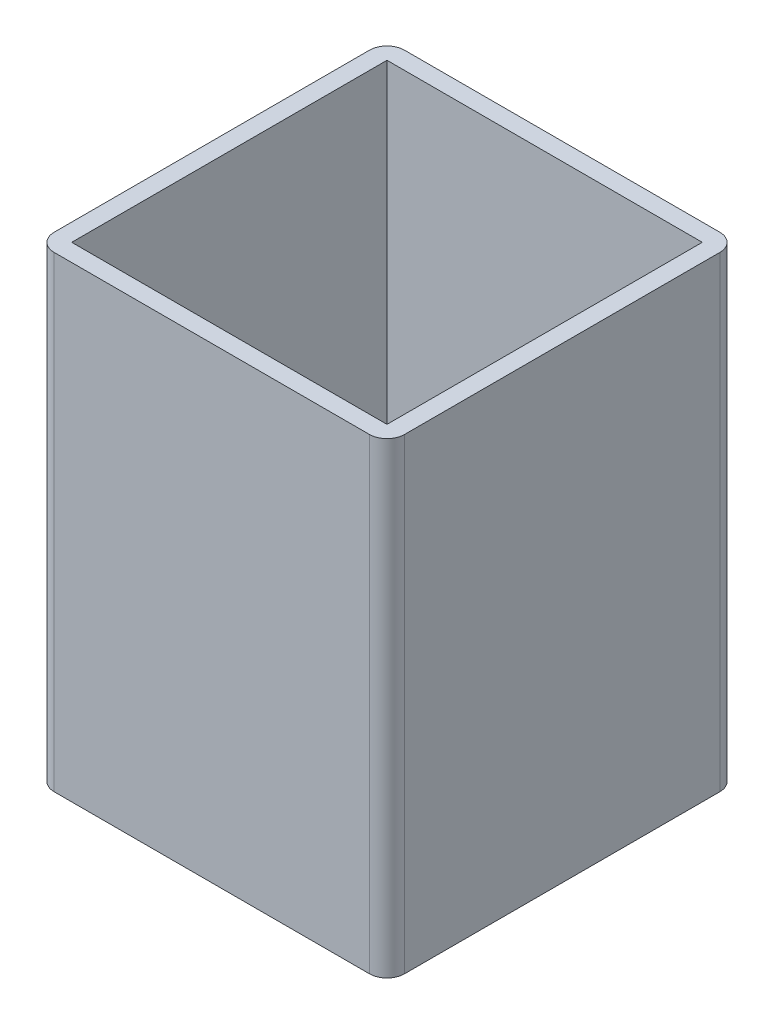
ISO-10303-21;
HEADER;
FILE_DESCRIPTION(('STEP AP214'),'2;1');
FILE_NAME('part.step','',(''),(''),'','','');
FILE_SCHEMA(('AUTOMOTIVE_DESIGN { 1 0 10303 214 1 1 1 1 }'));
ENDSEC;
DATA;
#1=APPLICATION_CONTEXT('core data for automotive mechanical design processes');
#2=APPLICATION_PROTOCOL_DEFINITION('international standard','automotive_design',2000,#1);
#3=PRODUCT_CONTEXT('',#1,'mechanical');
#4=PRODUCT('Part','Part','',(#3));
#5=PRODUCT_RELATED_PRODUCT_CATEGORY('part','',(#4));
#6=PRODUCT_DEFINITION_FORMATION('','',#4);
#7=PRODUCT_DEFINITION_CONTEXT('part definition',#1,'design');
#8=PRODUCT_DEFINITION('design','',#6,#7);
#9=PRODUCT_DEFINITION_SHAPE('','',#8);
#10=(LENGTH_UNIT() NAMED_UNIT(*) SI_UNIT(.MILLI.,.METRE.));
#11=(NAMED_UNIT(*) PLANE_ANGLE_UNIT() SI_UNIT($,.RADIAN.));
#12=(NAMED_UNIT(*) SI_UNIT($,.STERADIAN.) SOLID_ANGLE_UNIT());
#13=UNCERTAINTY_MEASURE_WITH_UNIT(LENGTH_MEASURE(1.E-05),#10,'distance_accuracy_value','');
#14=(GEOMETRIC_REPRESENTATION_CONTEXT(3) GLOBAL_UNCERTAINTY_ASSIGNED_CONTEXT((#13)) GLOBAL_UNIT_ASSIGNED_CONTEXT((#10,
#11,#12)) REPRESENTATION_CONTEXT('',''));
#15=CARTESIAN_POINT('',(0.,0.,0.));
#16=DIRECTION('',(0.,0.,1.));
#17=DIRECTION('',(1.,0.,0.));
#18=AXIS2_PLACEMENT_3D('',#15,#16,#17);
#19=CARTESIAN_POINT('',(0.,80.,0.));
#20=DIRECTION('',(0.,-1.,0.));
#21=DIRECTION('',(0.,0.,-1.));
#22=AXIS2_PLACEMENT_3D('',#19,#20,#21);
#23=PLANE('',#22);
#24=DIRECTION('',(-1.,0.,0.));
#25=VECTOR('',#24,1.);
#26=CARTESIAN_POINT('',(0.,80.,-60.));
#27=LINE('',#26,#25);
#28=CARTESIAN_POINT('',(57.,80.,-60.));
#29=VERTEX_POINT('',#28);
#30=CARTESIAN_POINT('',(3.,80.,-60.));
#31=VERTEX_POINT('',#30);
#32=EDGE_CURVE('E174',#29,#31,#27,.T.);
#33=ORIENTED_EDGE('',*,*,#32,.T.);
#34=CARTESIAN_POINT('',(3.,80.,-57.));
#35=DIRECTION('',(0.,-1.,0.));
#36=DIRECTION('',(0.,0.,-1.));
#37=AXIS2_PLACEMENT_3D('',#34,#35,#36);
#38=CIRCLE('',#37,3.);
#39=CARTESIAN_POINT('',(0.,80.,-57.));
#40=VERTEX_POINT('',#39);
#41=EDGE_CURVE('E209',#31,#40,#38,.F.);
#42=ORIENTED_EDGE('',*,*,#41,.T.);
#43=DIRECTION('',(0.,0.,1.));
#44=VECTOR('',#43,1.);
#45=CARTESIAN_POINT('',(0.,80.,0.));
#46=LINE('',#45,#44);
#47=CARTESIAN_POINT('',(0.,80.,-3.));
#48=VERTEX_POINT('',#47);
#49=EDGE_CURVE('E166',#40,#48,#46,.T.);
#50=ORIENTED_EDGE('',*,*,#49,.T.);
#51=CARTESIAN_POINT('',(3.,80.,-3.));
#52=DIRECTION('',(0.,-1.,0.));
#53=DIRECTION('',(0.,0.,-1.));
#54=AXIS2_PLACEMENT_3D('',#51,#52,#53);
#55=CIRCLE('',#54,3.);
#56=CARTESIAN_POINT('',(3.,80.,0.));
#57=VERTEX_POINT('',#56);
#58=EDGE_CURVE('E207',#48,#57,#55,.F.);
#59=ORIENTED_EDGE('',*,*,#58,.T.);
#60=DIRECTION('',(1.,0.,0.));
#61=VECTOR('',#60,1.);
#62=CARTESIAN_POINT('',(0.,80.,0.));
#63=LINE('',#62,#61);
#64=CARTESIAN_POINT('',(57.,80.,0.));
#65=VERTEX_POINT('',#64);
#66=EDGE_CURVE('E169',#57,#65,#63,.T.);
#67=ORIENTED_EDGE('',*,*,#66,.T.);
#68=CARTESIAN_POINT('',(57.,80.,-3.));
#69=DIRECTION('',(0.,-1.,0.));
#70=DIRECTION('',(0.,0.,-1.));
#71=AXIS2_PLACEMENT_3D('',#68,#69,#70);
#72=CIRCLE('',#71,3.);
#73=CARTESIAN_POINT('',(60.,80.,-3.));
#74=VERTEX_POINT('',#73);
#75=EDGE_CURVE('E55',#65,#74,#72,.F.);
#76=ORIENTED_EDGE('',*,*,#75,.T.);
#77=DIRECTION('',(0.,0.,-1.));
#78=VECTOR('',#77,1.);
#79=CARTESIAN_POINT('',(60.,80.,0.));
#80=LINE('',#79,#78);
#81=CARTESIAN_POINT('',(60.,80.,-57.));
#82=VERTEX_POINT('',#81);
#83=EDGE_CURVE('E172',#74,#82,#80,.T.);
#84=ORIENTED_EDGE('',*,*,#83,.T.);
#85=CARTESIAN_POINT('',(57.,80.,-57.));
#86=DIRECTION('',(0.,-1.,0.));
#87=DIRECTION('',(0.,0.,-1.));
#88=AXIS2_PLACEMENT_3D('',#85,#86,#87);
#89=CIRCLE('',#88,3.);
#90=EDGE_CURVE('E204',#82,#29,#89,.F.);
#91=ORIENTED_EDGE('',*,*,#90,.T.);
#92=EDGE_LOOP('',(#33,#42,#50,#59,#67,#76,#84,#91));
#93=FACE_BOUND('',#92,.T.);
#94=DIRECTION('',(0.,0.,1.));
#95=VECTOR('',#94,1.);
#96=CARTESIAN_POINT('',(3.,80.,-3.));
#97=LINE('',#96,#95);
#98=CARTESIAN_POINT('',(3.,80.,-57.));
#99=VERTEX_POINT('',#98);
#100=CARTESIAN_POINT('',(3.,80.,-3.));
#101=VERTEX_POINT('',#100);
#102=EDGE_CURVE('E125',#99,#101,#97,.T.);
#103=ORIENTED_EDGE('',*,*,#102,.F.);
#104=DIRECTION('',(-1.,0.,0.));
#105=VECTOR('',#104,1.);
#106=CARTESIAN_POINT('',(3.,80.,-57.));
#107=LINE('',#106,#105);
#108=CARTESIAN_POINT('',(57.,80.,-57.));
#109=VERTEX_POINT('',#108);
#110=EDGE_CURVE('E150',#109,#99,#107,.T.);
#111=ORIENTED_EDGE('',*,*,#110,.F.);
#112=DIRECTION('',(0.,0.,-1.));
#113=VECTOR('',#112,1.);
#114=CARTESIAN_POINT('',(57.,80.,-3.));
#115=LINE('',#114,#113);
#116=CARTESIAN_POINT('',(57.,80.,-3.));
#117=VERTEX_POINT('',#116);
#118=EDGE_CURVE('E148',#117,#109,#115,.T.);
#119=ORIENTED_EDGE('',*,*,#118,.F.);
#120=DIRECTION('',(1.,0.,0.));
#121=VECTOR('',#120,1.);
#122=CARTESIAN_POINT('',(3.,80.,-3.));
#123=LINE('',#122,#121);
#124=EDGE_CURVE('E135',#101,#117,#123,.T.);
#125=ORIENTED_EDGE('',*,*,#124,.F.);
#126=EDGE_LOOP('',(#103,#111,#119,#125));
#127=FACE_BOUND('',#126,.T.);
#128=ADVANCED_FACE('F34',(#93,#127),#23,.F.);
#129=CARTESIAN_POINT('',(0.,0.,0.));
#130=DIRECTION('',(0.,-1.,0.));
#131=DIRECTION('',(0.,0.,-1.));
#132=AXIS2_PLACEMENT_3D('',#129,#130,#131);
#133=PLANE('',#132);
#134=DIRECTION('',(0.,0.,1.));
#135=VECTOR('',#134,1.);
#136=CARTESIAN_POINT('',(0.,0.,0.));
#137=LINE('',#136,#135);
#138=CARTESIAN_POINT('',(0.,0.,-57.));
#139=VERTEX_POINT('',#138);
#140=CARTESIAN_POINT('',(0.,0.,-3.));
#141=VERTEX_POINT('',#140);
#142=EDGE_CURVE('E143',#139,#141,#137,.T.);
#143=ORIENTED_EDGE('',*,*,#142,.F.);
#144=CARTESIAN_POINT('',(3.,0.,-57.));
#145=DIRECTION('',(0.,-1.,0.));
#146=DIRECTION('',(0.,0.,-1.));
#147=AXIS2_PLACEMENT_3D('',#144,#145,#146);
#148=CIRCLE('',#147,3.);
#149=CARTESIAN_POINT('',(3.,0.,-60.));
#150=VERTEX_POINT('',#149);
#151=EDGE_CURVE('E197',#139,#150,#148,.T.);
#152=ORIENTED_EDGE('',*,*,#151,.T.);
#153=DIRECTION('',(-1.,0.,0.));
#154=VECTOR('',#153,1.);
#155=CARTESIAN_POINT('',(0.,0.,-60.));
#156=LINE('',#155,#154);
#157=CARTESIAN_POINT('',(57.,0.,-60.));
#158=VERTEX_POINT('',#157);
#159=EDGE_CURVE('E170',#158,#150,#156,.T.);
#160=ORIENTED_EDGE('',*,*,#159,.F.);
#161=CARTESIAN_POINT('',(57.,0.,-57.));
#162=DIRECTION('',(0.,-1.,0.));
#163=DIRECTION('',(0.,0.,-1.));
#164=AXIS2_PLACEMENT_3D('',#161,#162,#163);
#165=CIRCLE('',#164,3.);
#166=CARTESIAN_POINT('',(60.,0.,-57.));
#167=VERTEX_POINT('',#166);
#168=EDGE_CURVE('E191',#158,#167,#165,.T.);
#169=ORIENTED_EDGE('',*,*,#168,.T.);
#170=DIRECTION('',(0.,0.,-1.));
#171=VECTOR('',#170,1.);
#172=CARTESIAN_POINT('',(60.,0.,0.));
#173=LINE('',#172,#171);
#174=CARTESIAN_POINT('',(60.,0.,-3.));
#175=VERTEX_POINT('',#174);
#176=EDGE_CURVE('E183',#175,#167,#173,.T.);
#177=ORIENTED_EDGE('',*,*,#176,.F.);
#178=CARTESIAN_POINT('',(57.,0.,-3.));
#179=DIRECTION('',(0.,-1.,0.));
#180=DIRECTION('',(0.,0.,-1.));
#181=AXIS2_PLACEMENT_3D('',#178,#179,#180);
#182=CIRCLE('',#181,3.);
#183=CARTESIAN_POINT('',(57.,0.,0.));
#184=VERTEX_POINT('',#183);
#185=EDGE_CURVE('E193',#175,#184,#182,.T.);
#186=ORIENTED_EDGE('',*,*,#185,.T.);
#187=DIRECTION('',(1.,0.,0.));
#188=VECTOR('',#187,1.);
#189=CARTESIAN_POINT('',(0.,0.,0.));
#190=LINE('',#189,#188);
#191=CARTESIAN_POINT('',(3.,0.,0.));
#192=VERTEX_POINT('',#191);
#193=EDGE_CURVE('E180',#192,#184,#190,.T.);
#194=ORIENTED_EDGE('',*,*,#193,.F.);
#195=CARTESIAN_POINT('',(3.,0.,-3.));
#196=DIRECTION('',(0.,-1.,0.));
#197=DIRECTION('',(0.,0.,-1.));
#198=AXIS2_PLACEMENT_3D('',#195,#196,#197);
#199=CIRCLE('',#198,3.);
#200=EDGE_CURVE('E195',#192,#141,#199,.T.);
#201=ORIENTED_EDGE('',*,*,#200,.T.);
#202=EDGE_LOOP('',(#143,#152,#160,#169,#177,#186,#194,#201));
#203=FACE_BOUND('',#202,.T.);
#204=DIRECTION('',(-1.,0.,0.));
#205=VECTOR('',#204,1.);
#206=CARTESIAN_POINT('',(3.,0.,-57.));
#207=LINE('',#206,#205);
#208=CARTESIAN_POINT('',(57.,0.,-57.));
#209=VERTEX_POINT('',#208);
#210=CARTESIAN_POINT('',(3.,0.,-57.));
#211=VERTEX_POINT('',#210);
#212=EDGE_CURVE('E136',#209,#211,#207,.T.);
#213=ORIENTED_EDGE('',*,*,#212,.T.);
#214=DIRECTION('',(0.,0.,1.));
#215=VECTOR('',#214,1.);
#216=CARTESIAN_POINT('',(3.,0.,-3.));
#217=LINE('',#216,#215);
#218=CARTESIAN_POINT('',(3.,0.,-3.));
#219=VERTEX_POINT('',#218);
#220=EDGE_CURVE('E154',#211,#219,#217,.T.);
#221=ORIENTED_EDGE('',*,*,#220,.T.);
#222=DIRECTION('',(1.,0.,0.));
#223=VECTOR('',#222,1.);
#224=CARTESIAN_POINT('',(3.,0.,-3.));
#225=LINE('',#224,#223);
#226=CARTESIAN_POINT('',(57.,0.,-3.));
#227=VERTEX_POINT('',#226);
#228=EDGE_CURVE('E142',#219,#227,#225,.T.);
#229=ORIENTED_EDGE('',*,*,#228,.T.);
#230=DIRECTION('',(0.,0.,-1.));
#231=VECTOR('',#230,1.);
#232=CARTESIAN_POINT('',(57.,0.,-3.));
#233=LINE('',#232,#231);
#234=EDGE_CURVE('E157',#227,#209,#233,.T.);
#235=ORIENTED_EDGE('',*,*,#234,.T.);
#236=EDGE_LOOP('',(#213,#221,#229,#235));
#237=FACE_BOUND('',#236,.T.);
#238=ADVANCED_FACE('F225',(#203,#237),#133,.T.);
#239=CARTESIAN_POINT('',(0.,80.,0.));
#240=DIRECTION('',(1.,0.,0.));
#241=DIRECTION('',(0.,0.,-1.));
#242=AXIS2_PLACEMENT_3D('',#239,#240,#241);
#243=PLANE('',#242);
#244=ORIENTED_EDGE('',*,*,#49,.F.);
#245=DIRECTION('',(0.,-1.,0.));
#246=VECTOR('',#245,1.);
#247=CARTESIAN_POINT('',(0.,80.,-57.));
#248=LINE('',#247,#246);
#249=EDGE_CURVE('E188',#40,#139,#248,.T.);
#250=ORIENTED_EDGE('',*,*,#249,.T.);
#251=ORIENTED_EDGE('',*,*,#142,.T.);
#252=DIRECTION('',(0.,-1.,0.));
#253=VECTOR('',#252,1.);
#254=CARTESIAN_POINT('',(0.,80.,-3.));
#255=LINE('',#254,#253);
#256=EDGE_CURVE('E177',#141,#48,#255,.F.);
#257=ORIENTED_EDGE('',*,*,#256,.T.);
#258=EDGE_LOOP('',(#244,#250,#251,#257));
#259=FACE_BOUND('',#258,.T.);
#260=ADVANCED_FACE('F246',(#259),#243,.F.);
#261=CARTESIAN_POINT('',(0.,80.,0.));
#262=DIRECTION('',(0.,0.,-1.));
#263=DIRECTION('',(-1.,0.,0.));
#264=AXIS2_PLACEMENT_3D('',#261,#262,#263);
#265=PLANE('',#264);
#266=ORIENTED_EDGE('',*,*,#66,.F.);
#267=DIRECTION('',(0.,-1.,0.));
#268=VECTOR('',#267,1.);
#269=CARTESIAN_POINT('',(3.,80.,0.));
#270=LINE('',#269,#268);
#271=EDGE_CURVE('E213',#57,#192,#270,.T.);
#272=ORIENTED_EDGE('',*,*,#271,.T.);
#273=ORIENTED_EDGE('',*,*,#193,.T.);
#274=DIRECTION('',(0.,-1.,0.));
#275=VECTOR('',#274,1.);
#276=CARTESIAN_POINT('',(57.,80.,0.));
#277=LINE('',#276,#275);
#278=EDGE_CURVE('E211',#184,#65,#277,.F.);
#279=ORIENTED_EDGE('',*,*,#278,.T.);
#280=EDGE_LOOP('',(#266,#272,#273,#279));
#281=FACE_BOUND('',#280,.T.);
#282=ADVANCED_FACE('F219',(#281),#265,.F.);
#283=CARTESIAN_POINT('',(60.,80.,0.));
#284=DIRECTION('',(-1.,0.,0.));
#285=DIRECTION('',(0.,0.,1.));
#286=AXIS2_PLACEMENT_3D('',#283,#284,#285);
#287=PLANE('',#286);
#288=ORIENTED_EDGE('',*,*,#83,.F.);
#289=DIRECTION('',(0.,-1.,0.));
#290=VECTOR('',#289,1.);
#291=CARTESIAN_POINT('',(60.,80.,-3.));
#292=LINE('',#291,#290);
#293=EDGE_CURVE('E11',#74,#175,#292,.T.);
#294=ORIENTED_EDGE('',*,*,#293,.T.);
#295=ORIENTED_EDGE('',*,*,#176,.T.);
#296=DIRECTION('',(0.,-1.,0.));
#297=VECTOR('',#296,1.);
#298=CARTESIAN_POINT('',(60.,80.,-57.));
#299=LINE('',#298,#297);
#300=EDGE_CURVE('E42',#167,#82,#299,.F.);
#301=ORIENTED_EDGE('',*,*,#300,.T.);
#302=EDGE_LOOP('',(#288,#294,#295,#301));
#303=FACE_BOUND('',#302,.T.);
#304=ADVANCED_FACE('F231',(#303),#287,.F.);
#305=CARTESIAN_POINT('',(0.,80.,-60.));
#306=DIRECTION('',(0.,0.,1.));
#307=DIRECTION('',(1.,0.,0.));
#308=AXIS2_PLACEMENT_3D('',#305,#306,#307);
#309=PLANE('',#308);
#310=ORIENTED_EDGE('',*,*,#159,.T.);
#311=DIRECTION('',(0.,-1.,0.));
#312=VECTOR('',#311,1.);
#313=CARTESIAN_POINT('',(3.,80.,-60.));
#314=LINE('',#313,#312);
#315=EDGE_CURVE('E202',#150,#31,#314,.F.);
#316=ORIENTED_EDGE('',*,*,#315,.T.);
#317=ORIENTED_EDGE('',*,*,#32,.F.);
#318=DIRECTION('',(0.,-1.,0.));
#319=VECTOR('',#318,1.);
#320=CARTESIAN_POINT('',(57.,80.,-60.));
#321=LINE('',#320,#319);
#322=EDGE_CURVE('E199',#29,#158,#321,.T.);
#323=ORIENTED_EDGE('',*,*,#322,.T.);
#324=EDGE_LOOP('',(#310,#316,#317,#323));
#325=FACE_BOUND('',#324,.T.);
#326=ADVANCED_FACE('F238',(#325),#309,.F.);
#327=CARTESIAN_POINT('',(3.,80.,-3.));
#328=DIRECTION('',(1.,0.,0.));
#329=DIRECTION('',(0.,0.,-1.));
#330=AXIS2_PLACEMENT_3D('',#327,#328,#329);
#331=PLANE('',#330);
#332=ORIENTED_EDGE('',*,*,#220,.F.);
#333=DIRECTION('',(0.,-1.,0.));
#334=VECTOR('',#333,1.);
#335=CARTESIAN_POINT('',(3.,80.,-57.));
#336=LINE('',#335,#334);
#337=EDGE_CURVE('E131',#99,#211,#336,.T.);
#338=ORIENTED_EDGE('',*,*,#337,.F.);
#339=ORIENTED_EDGE('',*,*,#102,.T.);
#340=DIRECTION('',(0.,-1.,0.));
#341=VECTOR('',#340,1.);
#342=CARTESIAN_POINT('',(3.,80.,-3.));
#343=LINE('',#342,#341);
#344=EDGE_CURVE('E128',#101,#219,#343,.T.);
#345=ORIENTED_EDGE('',*,*,#344,.T.);
#346=EDGE_LOOP('',(#332,#338,#339,#345));
#347=FACE_BOUND('',#346,.T.);
#348=ADVANCED_FACE('F127',(#347),#331,.T.);
#349=CARTESIAN_POINT('',(3.,80.,-3.));
#350=DIRECTION('',(0.,0.,-1.));
#351=DIRECTION('',(-1.,0.,0.));
#352=AXIS2_PLACEMENT_3D('',#349,#350,#351);
#353=PLANE('',#352);
#354=ORIENTED_EDGE('',*,*,#228,.F.);
#355=ORIENTED_EDGE('',*,*,#344,.F.);
#356=ORIENTED_EDGE('',*,*,#124,.T.);
#357=DIRECTION('',(0.,-1.,0.));
#358=VECTOR('',#357,1.);
#359=CARTESIAN_POINT('',(57.,80.,-3.));
#360=LINE('',#359,#358);
#361=EDGE_CURVE('E144',#117,#227,#360,.T.);
#362=ORIENTED_EDGE('',*,*,#361,.T.);
#363=EDGE_LOOP('',(#354,#355,#356,#362));
#364=FACE_BOUND('',#363,.T.);
#365=ADVANCED_FACE('F139',(#364),#353,.T.);
#366=CARTESIAN_POINT('',(57.,80.,-3.));
#367=DIRECTION('',(-1.,0.,0.));
#368=DIRECTION('',(0.,0.,1.));
#369=AXIS2_PLACEMENT_3D('',#366,#367,#368);
#370=PLANE('',#369);
#371=ORIENTED_EDGE('',*,*,#234,.F.);
#372=ORIENTED_EDGE('',*,*,#361,.F.);
#373=ORIENTED_EDGE('',*,*,#118,.T.);
#374=DIRECTION('',(0.,-1.,0.));
#375=VECTOR('',#374,1.);
#376=CARTESIAN_POINT('',(57.,80.,-57.));
#377=LINE('',#376,#375);
#378=EDGE_CURVE('E163',#109,#209,#377,.T.);
#379=ORIENTED_EDGE('',*,*,#378,.T.);
#380=EDGE_LOOP('',(#371,#372,#373,#379));
#381=FACE_BOUND('',#380,.T.);
#382=ADVANCED_FACE('F301',(#381),#370,.T.);
#383=CARTESIAN_POINT('',(3.,80.,-57.));
#384=DIRECTION('',(0.,0.,1.));
#385=DIRECTION('',(1.,0.,0.));
#386=AXIS2_PLACEMENT_3D('',#383,#384,#385);
#387=PLANE('',#386);
#388=ORIENTED_EDGE('',*,*,#212,.F.);
#389=ORIENTED_EDGE('',*,*,#378,.F.);
#390=ORIENTED_EDGE('',*,*,#110,.T.);
#391=ORIENTED_EDGE('',*,*,#337,.T.);
#392=EDGE_LOOP('',(#388,#389,#390,#391));
#393=FACE_BOUND('',#392,.T.);
#394=ADVANCED_FACE('F255',(#393),#387,.T.);
#395=CARTESIAN_POINT('',(3.,80.,-57.));
#396=DIRECTION('',(0.,-1.,0.));
#397=DIRECTION('',(0.,0.,-1.));
#398=AXIS2_PLACEMENT_3D('',#395,#396,#397);
#399=CYLINDRICAL_SURFACE('',#398,3.);
#400=ORIENTED_EDGE('',*,*,#41,.F.);
#401=ORIENTED_EDGE('',*,*,#315,.F.);
#402=ORIENTED_EDGE('',*,*,#151,.F.);
#403=ORIENTED_EDGE('',*,*,#249,.F.);
#404=EDGE_LOOP('',(#400,#401,#402,#403));
#405=FACE_BOUND('',#404,.T.);
#406=ADVANCED_FACE('F243',(#405),#399,.T.);
#407=CARTESIAN_POINT('',(3.,80.,-3.));
#408=DIRECTION('',(0.,-1.,0.));
#409=DIRECTION('',(0.,0.,-1.));
#410=AXIS2_PLACEMENT_3D('',#407,#408,#409);
#411=CYLINDRICAL_SURFACE('',#410,3.);
#412=ORIENTED_EDGE('',*,*,#58,.F.);
#413=ORIENTED_EDGE('',*,*,#256,.F.);
#414=ORIENTED_EDGE('',*,*,#200,.F.);
#415=ORIENTED_EDGE('',*,*,#271,.F.);
#416=EDGE_LOOP('',(#412,#413,#414,#415));
#417=FACE_BOUND('',#416,.T.);
#418=ADVANCED_FACE('F248',(#417),#411,.T.);
#419=CARTESIAN_POINT('',(57.,80.,-3.));
#420=DIRECTION('',(0.,-1.,0.));
#421=DIRECTION('',(0.,0.,-1.));
#422=AXIS2_PLACEMENT_3D('',#419,#420,#421);
#423=CYLINDRICAL_SURFACE('',#422,3.);
#424=ORIENTED_EDGE('',*,*,#75,.F.);
#425=ORIENTED_EDGE('',*,*,#278,.F.);
#426=ORIENTED_EDGE('',*,*,#185,.F.);
#427=ORIENTED_EDGE('',*,*,#293,.F.);
#428=EDGE_LOOP('',(#424,#425,#426,#427));
#429=FACE_BOUND('',#428,.T.);
#430=ADVANCED_FACE('F230',(#429),#423,.T.);
#431=CARTESIAN_POINT('',(57.,80.,-57.));
#432=DIRECTION('',(0.,-1.,0.));
#433=DIRECTION('',(0.,0.,-1.));
#434=AXIS2_PLACEMENT_3D('',#431,#432,#433);
#435=CYLINDRICAL_SURFACE('',#434,3.);
#436=ORIENTED_EDGE('',*,*,#90,.F.);
#437=ORIENTED_EDGE('',*,*,#300,.F.);
#438=ORIENTED_EDGE('',*,*,#168,.F.);
#439=ORIENTED_EDGE('',*,*,#322,.F.);
#440=EDGE_LOOP('',(#436,#437,#438,#439));
#441=FACE_BOUND('',#440,.T.);
#442=ADVANCED_FACE('F36',(#441),#435,.T.);
#443=CLOSED_SHELL('',(#128,#238,#260,#282,#304,#326,#348,#365,#382,#394,#406,#418,#430,#442));
#444=MANIFOLD_SOLID_BREP('B2',#443);
#445=ADVANCED_BREP_SHAPE_REPRESENTATION('',(#18,#444),#14);
#446=SHAPE_DEFINITION_REPRESENTATION(#9,#445);
ENDSEC;
END-ISO-10303-21;
